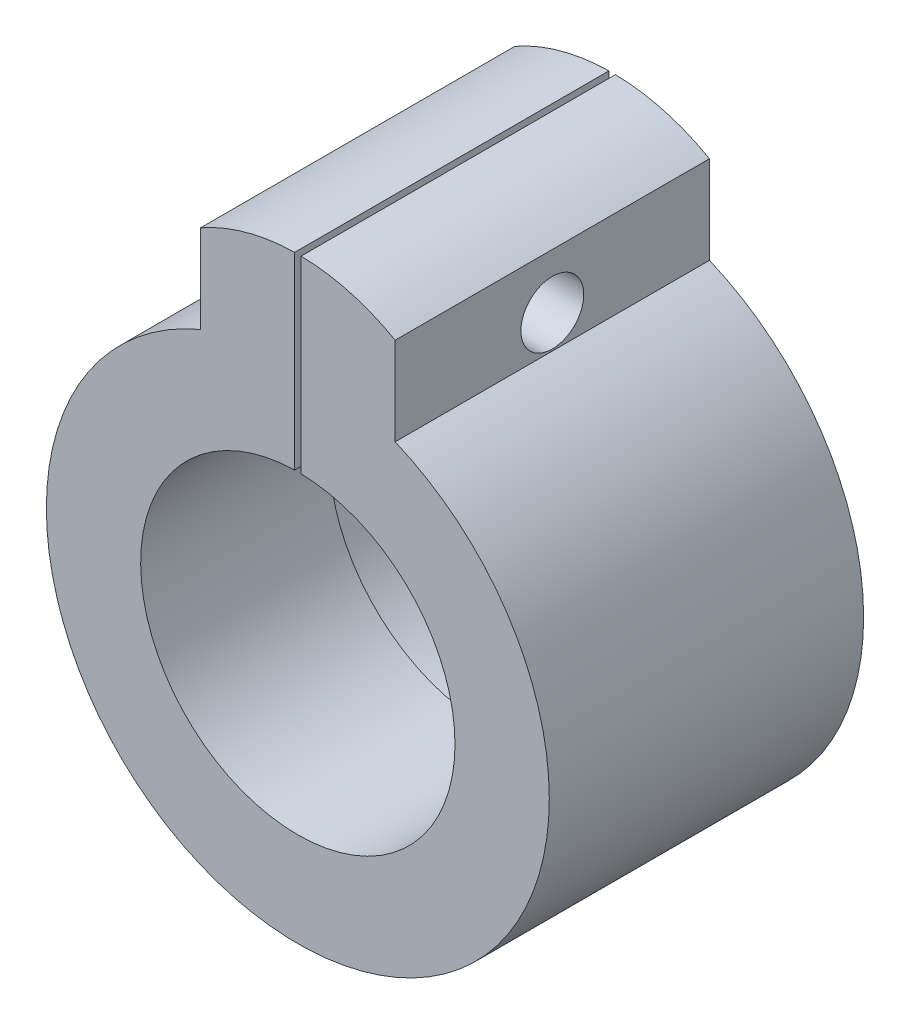
ISO-10303-21;
HEADER;
FILE_DESCRIPTION(('STEP AP214'),'2;1');
FILE_NAME('part.step','',(''),(''),'','','');
FILE_SCHEMA(('AUTOMOTIVE_DESIGN { 1 0 10303 214 1 1 1 1 }'));
ENDSEC;
DATA;
#1=APPLICATION_CONTEXT('core data for automotive mechanical design processes');
#2=APPLICATION_PROTOCOL_DEFINITION('international standard','automotive_design',2000,#1);
#3=PRODUCT_CONTEXT('',#1,'mechanical');
#4=PRODUCT('Part','Part','',(#3));
#5=PRODUCT_RELATED_PRODUCT_CATEGORY('part','',(#4));
#6=PRODUCT_DEFINITION_FORMATION('','',#4);
#7=PRODUCT_DEFINITION_CONTEXT('part definition',#1,'design');
#8=PRODUCT_DEFINITION('design','',#6,#7);
#9=PRODUCT_DEFINITION_SHAPE('','',#8);
#10=(LENGTH_UNIT() NAMED_UNIT(*) SI_UNIT(.MILLI.,.METRE.));
#11=(NAMED_UNIT(*) PLANE_ANGLE_UNIT() SI_UNIT($,.RADIAN.));
#12=(NAMED_UNIT(*) SI_UNIT($,.STERADIAN.) SOLID_ANGLE_UNIT());
#13=UNCERTAINTY_MEASURE_WITH_UNIT(LENGTH_MEASURE(1.E-05),#10,'distance_accuracy_value','');
#14=(GEOMETRIC_REPRESENTATION_CONTEXT(3) GLOBAL_UNCERTAINTY_ASSIGNED_CONTEXT((#13)) GLOBAL_UNIT_ASSIGNED_CONTEXT((#10,
#11,#12)) REPRESENTATION_CONTEXT('',''));
#15=CARTESIAN_POINT('',(0.,0.,0.));
#16=DIRECTION('',(0.,0.,1.));
#17=DIRECTION('',(1.,0.,0.));
#18=AXIS2_PLACEMENT_3D('',#15,#16,#17);
#19=CARTESIAN_POINT('',(0.,11.87489743787,10.));
#20=DIRECTION('',(0.,0.,-1.));
#21=DIRECTION('',(-1.,0.,0.));
#22=AXIS2_PLACEMENT_3D('',#19,#20,#21);
#23=CYLINDRICAL_SURFACE('',#22,15.6193467136848);
#24=DIRECTION('',(0.,0.,-1.));
#25=VECTOR('',#24,1.);
#26=CARTESIAN_POINT('',(-0.258597553957538,27.4921033040735,10.));
#27=LINE('',#26,#25);
#28=CARTESIAN_POINT('',(-0.258597553957538,27.4921033040735,0.));
#29=VERTEX_POINT('',#28);
#30=CARTESIAN_POINT('',(-0.258597553957538,27.4921033040735,25.));
#31=VERTEX_POINT('',#30);
#32=EDGE_CURVE('E169',#29,#31,#27,.F.);
#33=ORIENTED_EDGE('',*,*,#32,.F.);
#34=CARTESIAN_POINT('',(0.,11.87489743787,0.));
#35=DIRECTION('',(0.,0.,1.));
#36=DIRECTION('',(1.,0.,0.));
#37=AXIS2_PLACEMENT_3D('',#34,#35,#36);
#38=CIRCLE('',#37,15.6193467136848);
#39=CARTESIAN_POINT('',(-7.74027571439312,25.441478570472,0.));
#40=VERTEX_POINT('',#39);
#41=EDGE_CURVE('E150',#40,#29,#38,.F.);
#42=ORIENTED_EDGE('',*,*,#41,.F.);
#43=DIRECTION('',(0.,0.,-1.));
#44=VECTOR('',#43,1.);
#45=CARTESIAN_POINT('',(-7.74027571439312,25.441478570472,10.));
#46=LINE('',#45,#44);
#47=CARTESIAN_POINT('',(-7.74027571439312,25.441478570472,25.));
#48=VERTEX_POINT('',#47);
#49=EDGE_CURVE('E142',#48,#40,#46,.T.);
#50=ORIENTED_EDGE('',*,*,#49,.F.);
#51=CARTESIAN_POINT('',(0.,11.8748974378699,25.));
#52=DIRECTION('',(0.,0.,1.));
#53=DIRECTION('',(-1.,0.,0.));
#54=AXIS2_PLACEMENT_3D('',#51,#52,#53);
#55=CIRCLE('',#54,15.6193467136848);
#56=EDGE_CURVE('E161',#31,#48,#55,.T.);
#57=ORIENTED_EDGE('',*,*,#56,.F.);
#58=EDGE_LOOP('',(#33,#42,#50,#57));
#59=FACE_BOUND('',#58,.T.);
#60=ADVANCED_FACE('F36',(#59),#23,.T.);
#61=CARTESIAN_POINT('',(7.74027571439312,0.,10.));
#62=DIRECTION('',(-1.,0.,0.));
#63=DIRECTION('',(0.,0.,1.));
#64=AXIS2_PLACEMENT_3D('',#61,#62,#63);
#65=PLANE('',#64);
#66=CARTESIAN_POINT('',(7.74027571439312,21.0864235760214,12.5));
#67=DIRECTION('',(1.,0.,0.));
#68=DIRECTION('',(0.,0.,-1.));
#69=AXIS2_PLACEMENT_3D('',#66,#67,#68);
#70=CIRCLE('',#69,2.5);
#71=CARTESIAN_POINT('',(7.74027571439312,21.0864235760214,10.));
#72=VERTEX_POINT('',#71);
#73=EDGE_CURVE('E197',#72,#72,#70,.T.);
#74=ORIENTED_EDGE('',*,*,#73,.F.);
#75=EDGE_LOOP('',(#74));
#76=FACE_BOUND('',#75,.T.);
#77=DIRECTION('',(0.,1.,0.));
#78=VECTOR('',#77,1.);
#79=CARTESIAN_POINT('',(7.74027571439312,0.,0.));
#80=LINE('',#79,#78);
#81=CARTESIAN_POINT('',(7.74027571439312,18.441478570472,0.));
#82=VERTEX_POINT('',#81);
#83=CARTESIAN_POINT('',(7.74027571439312,25.441478570472,0.));
#84=VERTEX_POINT('',#83);
#85=EDGE_CURVE('E127',#82,#84,#80,.T.);
#86=ORIENTED_EDGE('',*,*,#85,.T.);
#87=DIRECTION('',(0.,0.,-1.));
#88=VECTOR('',#87,1.);
#89=CARTESIAN_POINT('',(7.74027571439312,25.441478570472,10.));
#90=LINE('',#89,#88);
#91=CARTESIAN_POINT('',(7.74027571439312,25.441478570472,25.));
#92=VERTEX_POINT('',#91);
#93=EDGE_CURVE('E139',#92,#84,#90,.T.);
#94=ORIENTED_EDGE('',*,*,#93,.F.);
#95=DIRECTION('',(0.,1.,0.));
#96=VECTOR('',#95,1.);
#97=CARTESIAN_POINT('',(7.74027571439312,18.441478570472,25.));
#98=LINE('',#97,#96);
#99=CARTESIAN_POINT('',(7.74027571439312,18.441478570472,25.));
#100=VERTEX_POINT('',#99);
#101=EDGE_CURVE('E137',#100,#92,#98,.T.);
#102=ORIENTED_EDGE('',*,*,#101,.F.);
#103=DIRECTION('',(0.,0.,-1.));
#104=VECTOR('',#103,1.);
#105=CARTESIAN_POINT('',(7.74027571439312,18.441478570472,10.));
#106=LINE('',#105,#104);
#107=EDGE_CURVE('E117',#100,#82,#106,.T.);
#108=ORIENTED_EDGE('',*,*,#107,.T.);
#109=EDGE_LOOP('',(#86,#94,#102,#108));
#110=FACE_BOUND('',#109,.T.);
#111=ADVANCED_FACE('F38',(#76,#110),#65,.F.);
#112=DIRECTION('',(0.,0.,-1.));
#113=VECTOR('',#112,1.);
#114=CARTESIAN_POINT('',(0.258597553957538,27.4921033040735,10.));
#115=LINE('',#114,#113);
#116=CARTESIAN_POINT('',(0.258597553957538,27.4921033040735,25.));
#117=VERTEX_POINT('',#116);
#118=CARTESIAN_POINT('',(0.258597553957538,27.4921033040735,0.));
#119=VERTEX_POINT('',#118);
#120=EDGE_CURVE('E181',#117,#119,#115,.T.);
#121=ORIENTED_EDGE('',*,*,#120,.F.);
#122=EDGE_CURVE('E158',#92,#117,#55,.T.);
#123=ORIENTED_EDGE('',*,*,#122,.F.);
#124=ORIENTED_EDGE('',*,*,#93,.T.);
#125=EDGE_CURVE('E131',#119,#84,#38,.F.);
#126=ORIENTED_EDGE('',*,*,#125,.F.);
#127=EDGE_LOOP('',(#121,#123,#124,#126));
#128=FACE_BOUND('',#127,.T.);
#129=ADVANCED_FACE('F219',(#128),#23,.T.);
#130=CARTESIAN_POINT('',(-7.74027571439312,0.,10.));
#131=DIRECTION('',(-1.,0.,0.));
#132=DIRECTION('',(0.,0.,1.));
#133=AXIS2_PLACEMENT_3D('',#130,#131,#132);
#134=PLANE('',#133);
#135=CARTESIAN_POINT('',(-7.74027571439312,21.0864235760214,12.5));
#136=DIRECTION('',(-1.,0.,0.));
#137=DIRECTION('',(0.,0.,1.));
#138=AXIS2_PLACEMENT_3D('',#135,#136,#137);
#139=CIRCLE('',#138,2.5);
#140=CARTESIAN_POINT('',(-7.74027571439312,21.0864235760214,15.));
#141=VERTEX_POINT('',#140);
#142=EDGE_CURVE('E191',#141,#141,#139,.T.);
#143=ORIENTED_EDGE('',*,*,#142,.F.);
#144=EDGE_LOOP('',(#143));
#145=FACE_BOUND('',#144,.T.);
#146=DIRECTION('',(0.,1.,0.));
#147=VECTOR('',#146,1.);
#148=CARTESIAN_POINT('',(-7.74027571439312,0.,0.));
#149=LINE('',#148,#147);
#150=CARTESIAN_POINT('',(-7.74027571439312,18.441478570472,0.));
#151=VERTEX_POINT('',#150);
#152=EDGE_CURVE('E124',#151,#40,#149,.T.);
#153=ORIENTED_EDGE('',*,*,#152,.F.);
#154=DIRECTION('',(0.,0.,-1.));
#155=VECTOR('',#154,1.);
#156=CARTESIAN_POINT('',(-7.74027571439312,18.441478570472,10.));
#157=LINE('',#156,#155);
#158=CARTESIAN_POINT('',(-7.74027571439312,18.441478570472,25.));
#159=VERTEX_POINT('',#158);
#160=EDGE_CURVE('E119',#159,#151,#157,.T.);
#161=ORIENTED_EDGE('',*,*,#160,.F.);
#162=DIRECTION('',(0.,-1.,0.));
#163=VECTOR('',#162,1.);
#164=CARTESIAN_POINT('',(-7.74027571439312,18.441478570472,25.));
#165=LINE('',#164,#163);
#166=EDGE_CURVE('E155',#48,#159,#165,.T.);
#167=ORIENTED_EDGE('',*,*,#166,.F.);
#168=ORIENTED_EDGE('',*,*,#49,.T.);
#169=EDGE_LOOP('',(#153,#161,#167,#168));
#170=FACE_BOUND('',#169,.T.);
#171=ADVANCED_FACE('F227',(#145,#170),#134,.T.);
#172=CARTESIAN_POINT('',(0.,0.,10.));
#173=DIRECTION('',(0.,0.,-1.));
#174=DIRECTION('',(-1.,0.,0.));
#175=AXIS2_PLACEMENT_3D('',#172,#173,#174);
#176=CYLINDRICAL_SURFACE('',#175,20.);
#177=CARTESIAN_POINT('',(0.,0.,0.));
#178=DIRECTION('',(0.,0.,1.));
#179=DIRECTION('',(1.,0.,0.));
#180=AXIS2_PLACEMENT_3D('',#177,#178,#179);
#181=CIRCLE('',#180,20.);
#182=EDGE_CURVE('E112',#151,#82,#181,.T.);
#183=ORIENTED_EDGE('',*,*,#182,.T.);
#184=ORIENTED_EDGE('',*,*,#107,.F.);
#185=CARTESIAN_POINT('',(0.,0.,25.));
#186=DIRECTION('',(0.,0.,1.));
#187=DIRECTION('',(1.,0.,0.));
#188=AXIS2_PLACEMENT_3D('',#185,#186,#187);
#189=CIRCLE('',#188,20.);
#190=EDGE_CURVE('E163',#159,#100,#189,.T.);
#191=ORIENTED_EDGE('',*,*,#190,.F.);
#192=ORIENTED_EDGE('',*,*,#160,.T.);
#193=EDGE_LOOP('',(#183,#184,#191,#192));
#194=FACE_BOUND('',#193,.T.);
#195=ADVANCED_FACE('F114',(#194),#176,.T.);
#196=CARTESIAN_POINT('',(0.,0.,10.));
#197=DIRECTION('',(0.,0.,-1.));
#198=DIRECTION('',(-1.,0.,0.));
#199=AXIS2_PLACEMENT_3D('',#196,#197,#198);
#200=CYLINDRICAL_SURFACE('',#199,13.);
#201=DIRECTION('',(0.,0.,-1.));
#202=VECTOR('',#201,1.);
#203=CARTESIAN_POINT('',(-0.258597553957538,12.9974277187868,10.));
#204=LINE('',#203,#202);
#205=CARTESIAN_POINT('',(-0.258597553957538,12.9974277187868,10.));
#206=VERTEX_POINT('',#205);
#207=CARTESIAN_POINT('',(-0.258597553957538,12.9974277187868,0.));
#208=VERTEX_POINT('',#207);
#209=EDGE_CURVE('E176',#206,#208,#204,.T.);
#210=ORIENTED_EDGE('',*,*,#209,.F.);
#211=CARTESIAN_POINT('',(0.,0.,10.));
#212=DIRECTION('',(0.,0.,1.));
#213=DIRECTION('',(1.,0.,0.));
#214=AXIS2_PLACEMENT_3D('',#211,#212,#213);
#215=CIRCLE('',#214,13.);
#216=CARTESIAN_POINT('',(0.258597553957538,12.9974277187868,10.));
#217=VERTEX_POINT('',#216);
#218=EDGE_CURVE('E134',#206,#217,#215,.T.);
#219=ORIENTED_EDGE('',*,*,#218,.T.);
#220=DIRECTION('',(0.,0.,-1.));
#221=VECTOR('',#220,1.);
#222=CARTESIAN_POINT('',(0.258597553957538,12.9974277187868,10.));
#223=LINE('',#222,#221);
#224=CARTESIAN_POINT('',(0.258597553957538,12.9974277187868,0.));
#225=VERTEX_POINT('',#224);
#226=EDGE_CURVE('E185',#225,#217,#223,.F.);
#227=ORIENTED_EDGE('',*,*,#226,.F.);
#228=CARTESIAN_POINT('',(0.,0.,0.));
#229=DIRECTION('',(0.,0.,1.));
#230=DIRECTION('',(1.,0.,0.));
#231=AXIS2_PLACEMENT_3D('',#228,#229,#230);
#232=CIRCLE('',#231,13.);
#233=EDGE_CURVE('E123',#208,#225,#232,.T.);
#234=ORIENTED_EDGE('',*,*,#233,.F.);
#235=EDGE_LOOP('',(#210,#219,#227,#234));
#236=FACE_BOUND('',#235,.T.);
#237=ADVANCED_FACE('F254',(#236),#200,.F.);
#238=CARTESIAN_POINT('',(0.,0.,0.));
#239=DIRECTION('',(0.,0.,1.));
#240=DIRECTION('',(1.,0.,0.));
#241=AXIS2_PLACEMENT_3D('',#238,#239,#240);
#242=PLANE('',#241);
#243=ORIENTED_EDGE('',*,*,#85,.F.);
#244=ORIENTED_EDGE('',*,*,#182,.F.);
#245=ORIENTED_EDGE('',*,*,#152,.T.);
#246=ORIENTED_EDGE('',*,*,#41,.T.);
#247=DIRECTION('',(0.,-1.,0.));
#248=VECTOR('',#247,1.);
#249=CARTESIAN_POINT('',(-0.258597553957538,0.,0.));
#250=LINE('',#249,#248);
#251=EDGE_CURVE('E173',#29,#208,#250,.T.);
#252=ORIENTED_EDGE('',*,*,#251,.T.);
#253=ORIENTED_EDGE('',*,*,#233,.T.);
#254=DIRECTION('',(0.,1.,0.));
#255=VECTOR('',#254,1.);
#256=CARTESIAN_POINT('',(0.258597553957538,0.,0.));
#257=LINE('',#256,#255);
#258=EDGE_CURVE('E183',#225,#119,#257,.T.);
#259=ORIENTED_EDGE('',*,*,#258,.T.);
#260=ORIENTED_EDGE('',*,*,#125,.T.);
#261=EDGE_LOOP('',(#243,#244,#245,#246,#252,#253,#259,#260));
#262=FACE_BOUND('',#261,.T.);
#263=ADVANCED_FACE('F128',(#262),#242,.F.);
#264=CARTESIAN_POINT('',(0.,0.,25.));
#265=DIRECTION('',(0.,0.,1.));
#266=DIRECTION('',(1.,0.,0.));
#267=AXIS2_PLACEMENT_3D('',#264,#265,#266);
#268=PLANE('',#267);
#269=DIRECTION('',(0.,-1.,0.));
#270=VECTOR('',#269,1.);
#271=CARTESIAN_POINT('',(-0.258597553957538,12.3781063786396,25.));
#272=LINE('',#271,#270);
#273=CARTESIAN_POINT('',(-0.258597553957538,12.497324805937,25.));
#274=VERTEX_POINT('',#273);
#275=EDGE_CURVE('E59',#31,#274,#272,.T.);
#276=ORIENTED_EDGE('',*,*,#275,.F.);
#277=ORIENTED_EDGE('',*,*,#56,.T.);
#278=ORIENTED_EDGE('',*,*,#166,.T.);
#279=ORIENTED_EDGE('',*,*,#190,.T.);
#280=ORIENTED_EDGE('',*,*,#101,.T.);
#281=ORIENTED_EDGE('',*,*,#122,.T.);
#282=DIRECTION('',(0.,1.,0.));
#283=VECTOR('',#282,1.);
#284=CARTESIAN_POINT('',(0.258597553957538,12.3781063786396,25.));
#285=LINE('',#284,#283);
#286=CARTESIAN_POINT('',(0.258597553957538,12.497324805937,25.));
#287=VERTEX_POINT('',#286);
#288=EDGE_CURVE('E189',#287,#117,#285,.T.);
#289=ORIENTED_EDGE('',*,*,#288,.F.);
#290=CARTESIAN_POINT('',(0.,0.,25.));
#291=DIRECTION('',(0.,0.,1.));
#292=DIRECTION('',(1.,0.,0.));
#293=AXIS2_PLACEMENT_3D('',#290,#291,#292);
#294=CIRCLE('',#293,12.5);
#295=EDGE_CURVE('E165',#274,#287,#294,.T.);
#296=ORIENTED_EDGE('',*,*,#295,.F.);
#297=EDGE_LOOP('',(#276,#277,#278,#279,#280,#281,#289,#296));
#298=FACE_BOUND('',#297,.T.);
#299=ADVANCED_FACE('F237',(#298),#268,.T.);
#300=CARTESIAN_POINT('',(0.,0.,10.));
#301=DIRECTION('',(0.,0.,1.));
#302=DIRECTION('',(1.,0.,0.));
#303=AXIS2_PLACEMENT_3D('',#300,#301,#302);
#304=PLANE('',#303);
#305=ORIENTED_EDGE('',*,*,#218,.F.);
#306=DIRECTION('',(0.,-1.,0.));
#307=VECTOR('',#306,1.);
#308=CARTESIAN_POINT('',(-0.258597553957538,0.,10.));
#309=LINE('',#308,#307);
#310=CARTESIAN_POINT('',(-0.258597553957538,12.497324805937,10.));
#311=VERTEX_POINT('',#310);
#312=EDGE_CURVE('E178',#206,#311,#309,.T.);
#313=ORIENTED_EDGE('',*,*,#312,.T.);
#314=CARTESIAN_POINT('',(0.,0.,10.));
#315=DIRECTION('',(0.,0.,1.));
#316=DIRECTION('',(1.,0.,0.));
#317=AXIS2_PLACEMENT_3D('',#314,#315,#316);
#318=CIRCLE('',#317,12.5);
#319=CARTESIAN_POINT('',(0.258597553957538,12.497324805937,10.));
#320=VERTEX_POINT('',#319);
#321=EDGE_CURVE('E166',#311,#320,#318,.T.);
#322=ORIENTED_EDGE('',*,*,#321,.T.);
#323=DIRECTION('',(0.,1.,0.));
#324=VECTOR('',#323,1.);
#325=CARTESIAN_POINT('',(0.258597553957538,0.,10.));
#326=LINE('',#325,#324);
#327=EDGE_CURVE('E52',#320,#217,#326,.T.);
#328=ORIENTED_EDGE('',*,*,#327,.T.);
#329=EDGE_LOOP('',(#305,#313,#322,#328));
#330=FACE_BOUND('',#329,.T.);
#331=ADVANCED_FACE('F251',(#330),#304,.F.);
#332=CARTESIAN_POINT('',(0.,0.,25.));
#333=DIRECTION('',(0.,0.,-1.));
#334=DIRECTION('',(-1.,0.,0.));
#335=AXIS2_PLACEMENT_3D('',#332,#333,#334);
#336=CYLINDRICAL_SURFACE('',#335,12.5);
#337=DIRECTION('',(0.,0.,-1.));
#338=VECTOR('',#337,1.);
#339=CARTESIAN_POINT('',(-0.258597553957538,12.497324805937,25.));
#340=LINE('',#339,#338);
#341=EDGE_CURVE('E11',#274,#311,#340,.T.);
#342=ORIENTED_EDGE('',*,*,#341,.F.);
#343=ORIENTED_EDGE('',*,*,#295,.T.);
#344=DIRECTION('',(0.,0.,-1.));
#345=VECTOR('',#344,1.);
#346=CARTESIAN_POINT('',(0.258597553957538,12.497324805937,25.));
#347=LINE('',#346,#345);
#348=EDGE_CURVE('E45',#320,#287,#347,.F.);
#349=ORIENTED_EDGE('',*,*,#348,.F.);
#350=ORIENTED_EDGE('',*,*,#321,.F.);
#351=EDGE_LOOP('',(#342,#343,#349,#350));
#352=FACE_BOUND('',#351,.T.);
#353=ADVANCED_FACE('F246',(#352),#336,.F.);
#354=CARTESIAN_POINT('',(0.258597553957538,12.3781063786396,-2.50000000007189E-05));
#355=DIRECTION('',(1.,0.,0.));
#356=DIRECTION('',(0.,0.,-1.));
#357=AXIS2_PLACEMENT_3D('',#354,#355,#356);
#358=PLANE('',#357);
#359=CARTESIAN_POINT('',(0.258597553957539,21.0864235760214,12.5));
#360=DIRECTION('',(1.,0.,0.));
#361=DIRECTION('',(0.,0.,-1.));
#362=AXIS2_PLACEMENT_3D('',#359,#360,#361);
#363=CIRCLE('',#362,2.5);
#364=CARTESIAN_POINT('',(0.258597553957539,21.0864235760214,10.));
#365=VERTEX_POINT('',#364);
#366=EDGE_CURVE('E194',#365,#365,#363,.T.);
#367=ORIENTED_EDGE('',*,*,#366,.T.);
#368=EDGE_LOOP('',(#367));
#369=FACE_BOUND('',#368,.T.);
#370=ORIENTED_EDGE('',*,*,#120,.T.);
#371=ORIENTED_EDGE('',*,*,#258,.F.);
#372=ORIENTED_EDGE('',*,*,#226,.T.);
#373=ORIENTED_EDGE('',*,*,#327,.F.);
#374=ORIENTED_EDGE('',*,*,#348,.T.);
#375=ORIENTED_EDGE('',*,*,#288,.T.);
#376=EDGE_LOOP('',(#370,#371,#372,#373,#374,#375));
#377=FACE_BOUND('',#376,.T.);
#378=ADVANCED_FACE('F215',(#369,#377),#358,.F.);
#379=CARTESIAN_POINT('',(-0.258597553957538,12.3781063786396,-2.50000000007189E-05));
#380=DIRECTION('',(-1.,0.,0.));
#381=DIRECTION('',(0.,0.,1.));
#382=AXIS2_PLACEMENT_3D('',#379,#380,#381);
#383=PLANE('',#382);
#384=CARTESIAN_POINT('',(-0.258597553957539,21.0864235760214,12.5));
#385=DIRECTION('',(-1.,0.,0.));
#386=DIRECTION('',(0.,0.,1.));
#387=AXIS2_PLACEMENT_3D('',#384,#385,#386);
#388=CIRCLE('',#387,2.5);
#389=CARTESIAN_POINT('',(-0.258597553957539,21.0864235760214,15.));
#390=VERTEX_POINT('',#389);
#391=EDGE_CURVE('E40',#390,#390,#388,.T.);
#392=ORIENTED_EDGE('',*,*,#391,.T.);
#393=EDGE_LOOP('',(#392));
#394=FACE_BOUND('',#393,.T.);
#395=ORIENTED_EDGE('',*,*,#32,.T.);
#396=ORIENTED_EDGE('',*,*,#275,.T.);
#397=ORIENTED_EDGE('',*,*,#341,.T.);
#398=ORIENTED_EDGE('',*,*,#312,.F.);
#399=ORIENTED_EDGE('',*,*,#209,.T.);
#400=ORIENTED_EDGE('',*,*,#251,.F.);
#401=EDGE_LOOP('',(#395,#396,#397,#398,#399,#400));
#402=FACE_BOUND('',#401,.T.);
#403=ADVANCED_FACE('F204',(#394,#402),#383,.F.);
#404=CARTESIAN_POINT('',(-35.0000250000568,21.0864235760214,12.5));
#405=DIRECTION('',(1.,0.,0.));
#406=DIRECTION('',(0.,0.,-1.));
#407=AXIS2_PLACEMENT_3D('',#404,#405,#406);
#408=CYLINDRICAL_SURFACE('',#407,2.5);
#409=ORIENTED_EDGE('',*,*,#142,.T.);
#410=EDGE_LOOP('',(#409));
#411=FACE_BOUND('',#410,.T.);
#412=ORIENTED_EDGE('',*,*,#391,.F.);
#413=EDGE_LOOP('',(#412));
#414=FACE_BOUND('',#413,.T.);
#415=ADVANCED_FACE('F206',(#411,#414),#408,.F.);
#416=ORIENTED_EDGE('',*,*,#73,.T.);
#417=EDGE_LOOP('',(#416));
#418=FACE_BOUND('',#417,.T.);
#419=ORIENTED_EDGE('',*,*,#366,.F.);
#420=EDGE_LOOP('',(#419));
#421=FACE_BOUND('',#420,.T.);
#422=ADVANCED_FACE('F208',(#418,#421),#408,.F.);
#423=CLOSED_SHELL('',(#60,#111,#129,#171,#195,#237,#263,#299,#331,#353,#378,#403,#415,#422));
#424=MANIFOLD_SOLID_BREP('B2',#423);
#425=ADVANCED_BREP_SHAPE_REPRESENTATION('',(#18,#424),#14);
#426=SHAPE_DEFINITION_REPRESENTATION(#9,#425);
ENDSEC;
END-ISO-10303-21;
